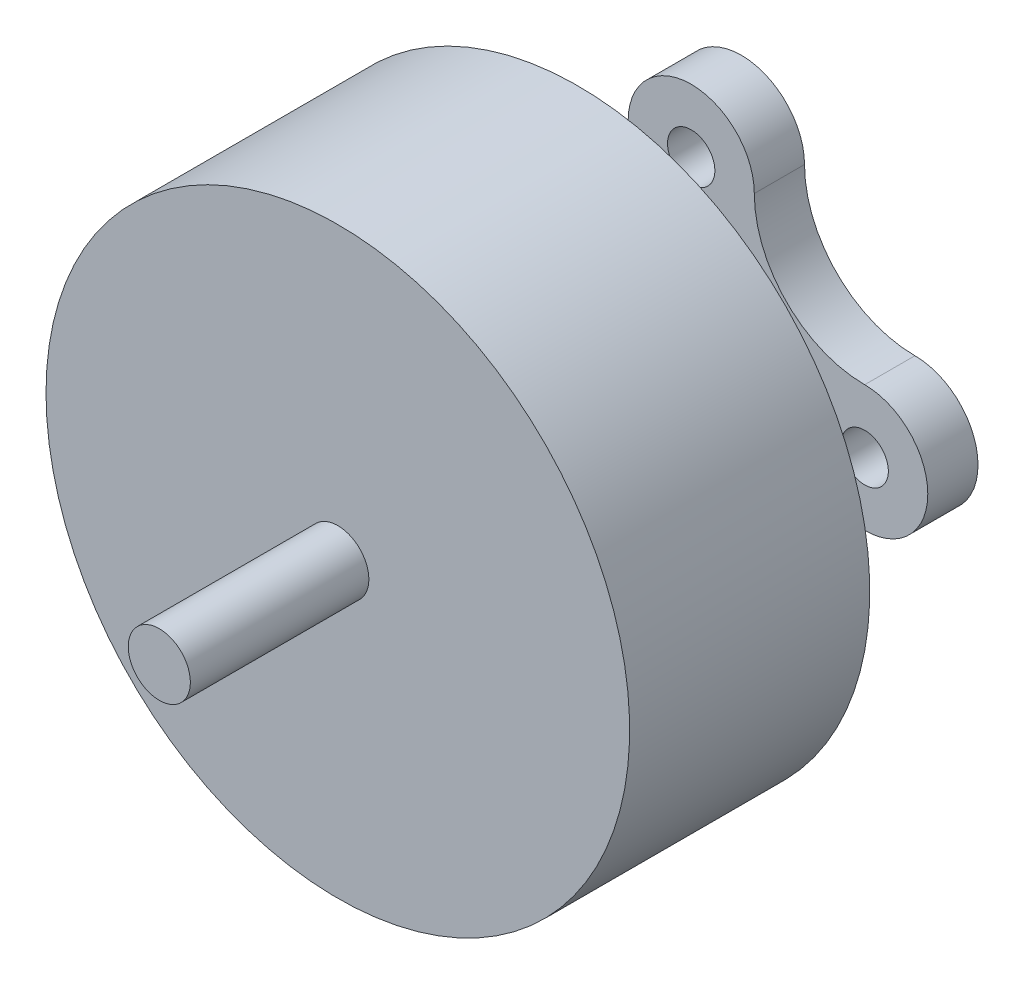
ISO-10303-21;
HEADER;
FILE_DESCRIPTION(('STEP AP214'),'2;1');
FILE_NAME('part.step','',(''),(''),'','','');
FILE_SCHEMA(('AUTOMOTIVE_DESIGN { 1 0 10303 214 1 1 1 1 }'));
ENDSEC;
DATA;
#1=APPLICATION_CONTEXT('core data for automotive mechanical design processes');
#2=APPLICATION_PROTOCOL_DEFINITION('international standard','automotive_design',2000,#1);
#3=PRODUCT_CONTEXT('',#1,'mechanical');
#4=PRODUCT('Part','Part','',(#3));
#5=PRODUCT_RELATED_PRODUCT_CATEGORY('part','',(#4));
#6=PRODUCT_DEFINITION_FORMATION('','',#4);
#7=PRODUCT_DEFINITION_CONTEXT('part definition',#1,'design');
#8=PRODUCT_DEFINITION('design','',#6,#7);
#9=PRODUCT_DEFINITION_SHAPE('','',#8);
#10=(LENGTH_UNIT() NAMED_UNIT(*) SI_UNIT(.MILLI.,.METRE.));
#11=(NAMED_UNIT(*) PLANE_ANGLE_UNIT() SI_UNIT($,.RADIAN.));
#12=(NAMED_UNIT(*) SI_UNIT($,.STERADIAN.) SOLID_ANGLE_UNIT());
#13=UNCERTAINTY_MEASURE_WITH_UNIT(LENGTH_MEASURE(1.E-05),#10,'distance_accuracy_value','');
#14=(GEOMETRIC_REPRESENTATION_CONTEXT(3) GLOBAL_UNCERTAINTY_ASSIGNED_CONTEXT((#13)) GLOBAL_UNIT_ASSIGNED_CONTEXT((#10,
#11,#12)) REPRESENTATION_CONTEXT('',''));
#15=CARTESIAN_POINT('',(0.,0.,0.));
#16=DIRECTION('',(0.,0.,1.));
#17=DIRECTION('',(1.,0.,0.));
#18=AXIS2_PLACEMENT_3D('',#15,#16,#17);
#19=CARTESIAN_POINT('',(9.4,0.,1.61731638714045));
#20=DIRECTION('',(0.,0.,1.));
#21=DIRECTION('',(1.,0.,0.));
#22=AXIS2_PLACEMENT_3D('',#19,#20,#21);
#23=PLANE('',#22);
#24=CARTESIAN_POINT('',(0.,0.,1.61731638714045));
#25=DIRECTION('',(0.,0.,-1.));
#26=DIRECTION('',(-1.,0.,0.));
#27=AXIS2_PLACEMENT_3D('',#24,#25,#26);
#28=CIRCLE('',#27,1.68292059225708);
#29=CARTESIAN_POINT('',(-1.68292059225708,0.,1.61731638714045));
#30=VERTEX_POINT('',#29);
#31=EDGE_CURVE('E235',#30,#30,#28,.T.);
#32=ORIENTED_EDGE('',*,*,#31,.T.);
#33=EDGE_LOOP('',(#32));
#34=FACE_BOUND('',#33,.T.);
#35=CARTESIAN_POINT('',(5.58799999999995,5.58800000000007,1.61731638714045));
#36=DIRECTION('',(0.,0.,1.));
#37=DIRECTION('',(1.,0.,0.));
#38=AXIS2_PLACEMENT_3D('',#35,#36,#37);
#39=CIRCLE('',#38,3.55600000000001);
#40=CARTESIAN_POINT('',(5.58799999999998,2.03200000000004,1.61731638714045));
#41=VERTEX_POINT('',#40);
#42=CARTESIAN_POINT('',(2.03199999999994,5.58800000000004,1.61731638714045));
#43=VERTEX_POINT('',#42);
#44=EDGE_CURVE('E160',#41,#43,#39,.F.);
#45=ORIENTED_EDGE('',*,*,#44,.T.);
#46=CARTESIAN_POINT('',(0.,5.588,1.61731638714045));
#47=DIRECTION('',(0.,0.,1.));
#48=DIRECTION('',(1.,0.,0.));
#49=AXIS2_PLACEMENT_3D('',#46,#47,#48);
#50=CIRCLE('',#49,2.032);
#51=CARTESIAN_POINT('',(-2.03200000000006,5.588,1.61731638714045));
#52=VERTEX_POINT('',#51);
#53=EDGE_CURVE('E146',#43,#52,#50,.T.);
#54=ORIENTED_EDGE('',*,*,#53,.T.);
#55=CARTESIAN_POINT('',(-5.58800000000001,5.58800000000001,1.61731638714045));
#56=DIRECTION('',(0.,0.,1.));
#57=DIRECTION('',(1.,0.,0.));
#58=AXIS2_PLACEMENT_3D('',#55,#56,#57);
#59=CIRCLE('',#58,3.55600000000001);
#60=CARTESIAN_POINT('',(-5.58800000000002,2.032,1.61731638714045));
#61=VERTEX_POINT('',#60);
#62=EDGE_CURVE('E134',#52,#61,#59,.F.);
#63=ORIENTED_EDGE('',*,*,#62,.T.);
#64=CARTESIAN_POINT('',(-5.588,0.,1.61731638714045));
#65=DIRECTION('',(0.,0.,1.));
#66=DIRECTION('',(1.,0.,0.));
#67=AXIS2_PLACEMENT_3D('',#64,#65,#66);
#68=CIRCLE('',#67,2.032);
#69=CARTESIAN_POINT('',(-5.58799999999999,-2.032,1.61731638714045));
#70=VERTEX_POINT('',#69);
#71=EDGE_CURVE('E145',#61,#70,#68,.T.);
#72=ORIENTED_EDGE('',*,*,#71,.T.);
#73=CARTESIAN_POINT('',(-5.58799999999999,-5.58800000000003,1.61731638714045));
#74=DIRECTION('',(0.,0.,1.));
#75=DIRECTION('',(1.,0.,0.));
#76=AXIS2_PLACEMENT_3D('',#73,#74,#75);
#77=CIRCLE('',#76,3.55600000000001);
#78=CARTESIAN_POINT('',(-2.03199999999998,-5.58800000000003,1.61731638714045));
#79=VERTEX_POINT('',#78);
#80=EDGE_CURVE('E174',#70,#79,#77,.F.);
#81=ORIENTED_EDGE('',*,*,#80,.T.);
#82=CARTESIAN_POINT('',(0.,-5.588,1.61731638714045));
#83=DIRECTION('',(0.,0.,1.));
#84=DIRECTION('',(1.,0.,0.));
#85=AXIS2_PLACEMENT_3D('',#82,#83,#84);
#86=CIRCLE('',#85,2.032);
#87=CARTESIAN_POINT('',(2.03200000000002,-5.588,1.61731638714045));
#88=VERTEX_POINT('',#87);
#89=EDGE_CURVE('E178',#79,#88,#86,.T.);
#90=ORIENTED_EDGE('',*,*,#89,.T.);
#91=CARTESIAN_POINT('',(5.58800000000005,-5.58799999999997,1.61731638714045));
#92=DIRECTION('',(0.,0.,1.));
#93=DIRECTION('',(1.,0.,0.));
#94=AXIS2_PLACEMENT_3D('',#91,#92,#93);
#95=CIRCLE('',#94,3.55600000000001);
#96=CARTESIAN_POINT('',(5.58800000000004,-2.03199999999996,1.61731638714045));
#97=VERTEX_POINT('',#96);
#98=EDGE_CURVE('E182',#88,#97,#95,.F.);
#99=ORIENTED_EDGE('',*,*,#98,.T.);
#100=CARTESIAN_POINT('',(5.588,0.,1.61731638714045));
#101=DIRECTION('',(0.,0.,1.));
#102=DIRECTION('',(1.,0.,0.));
#103=AXIS2_PLACEMENT_3D('',#100,#101,#102);
#104=CIRCLE('',#103,2.032);
#105=EDGE_CURVE('E186',#97,#41,#104,.T.);
#106=ORIENTED_EDGE('',*,*,#105,.T.);
#107=EDGE_LOOP('',(#45,#54,#63,#72,#81,#90,#99,#106));
#108=FACE_BOUND('',#107,.T.);
#109=CARTESIAN_POINT('',(5.58799999999987,-1.57794013350052E-13,1.61731638714045));
#110=DIRECTION('',(0.,0.,1.));
#111=DIRECTION('',(1.,0.,0.));
#112=AXIS2_PLACEMENT_3D('',#109,#110,#111);
#113=CIRCLE('',#112,0.762000000000303);
#114=CARTESIAN_POINT('',(6.35000000000017,-1.57794013350052E-13,1.61731638714045));
#115=VERTEX_POINT('',#114);
#116=EDGE_CURVE('E324',#115,#115,#113,.F.);
#117=ORIENTED_EDGE('',*,*,#116,.T.);
#118=EDGE_LOOP('',(#117));
#119=FACE_BOUND('',#118,.T.);
#120=CARTESIAN_POINT('',(0.,5.588,1.61731638714045));
#121=DIRECTION('',(0.,0.,1.));
#122=DIRECTION('',(1.,0.,0.));
#123=AXIS2_PLACEMENT_3D('',#120,#121,#122);
#124=CIRCLE('',#123,0.762);
#125=CARTESIAN_POINT('',(0.761999999999941,5.588,1.61731638714045));
#126=VERTEX_POINT('',#125);
#127=EDGE_CURVE('E327',#126,#126,#124,.F.);
#128=ORIENTED_EDGE('',*,*,#127,.T.);
#129=EDGE_LOOP('',(#128));
#130=FACE_BOUND('',#129,.T.);
#131=CARTESIAN_POINT('',(-5.58800000000018,1.57109680718689E-13,1.61731638714045));
#132=DIRECTION('',(0.,0.,1.));
#133=DIRECTION('',(1.,0.,0.));
#134=AXIS2_PLACEMENT_3D('',#131,#132,#133);
#135=CIRCLE('',#134,0.762000000000173);
#136=CARTESIAN_POINT('',(-4.826,1.57109680718689E-13,1.61731638714045));
#137=VERTEX_POINT('',#136);
#138=EDGE_CURVE('E169',#137,#137,#135,.F.);
#139=ORIENTED_EDGE('',*,*,#138,.T.);
#140=EDGE_LOOP('',(#139));
#141=FACE_BOUND('',#140,.T.);
#142=CARTESIAN_POINT('',(-3.13877195121696E-13,-5.58800000000002,1.61731638714045));
#143=DIRECTION('',(0.,0.,1.));
#144=DIRECTION('',(1.,0.,0.));
#145=AXIS2_PLACEMENT_3D('',#142,#143,#144);
#146=CIRCLE('',#145,0.762000000000387);
#147=CARTESIAN_POINT('',(0.762000000000073,-5.58800000000002,1.61731638714045));
#148=VERTEX_POINT('',#147);
#149=EDGE_CURVE('E162',#148,#148,#146,.F.);
#150=ORIENTED_EDGE('',*,*,#149,.T.);
#151=EDGE_LOOP('',(#150));
#152=FACE_BOUND('',#151,.T.);
#153=ADVANCED_FACE('F67',(#34,#108,#119,#130,#141,#152),#23,.T.);
#154=CARTESIAN_POINT('',(0.,0.,13.));
#155=DIRECTION('',(0.,0.,-1.));
#156=DIRECTION('',(-1.,0.,0.));
#157=AXIS2_PLACEMENT_3D('',#154,#155,#156);
#158=CYLINDRICAL_SURFACE('',#157,9.4);
#159=CARTESIAN_POINT('',(0.,0.,13.));
#160=DIRECTION('',(0.,0.,1.));
#161=DIRECTION('',(1.,0.,0.));
#162=AXIS2_PLACEMENT_3D('',#159,#160,#161);
#163=CIRCLE('',#162,9.4);
#164=CARTESIAN_POINT('',(-9.4,0.,13.));
#165=VERTEX_POINT('',#164);
#166=EDGE_CURVE('E12',#165,#165,#163,.T.);
#167=CARTESIAN_POINT('',(0.,0.,5.26635248511029));
#168=DIRECTION('',(0.,0.,-1.));
#169=DIRECTION('',(-1.,0.,0.));
#170=AXIS2_PLACEMENT_3D('',#167,#168,#169);
#171=CIRCLE('',#170,9.4);
#172=CARTESIAN_POINT('',(-9.4,0.,5.26635248511029));
#173=VERTEX_POINT('',#172);
#174=EDGE_CURVE('E243',#173,#173,#171,.T.);
#175=CARTESIAN_POINT('',(-9.4,0.,13.));
#176=CARTESIAN_POINT('',(-9.4,0.,12.9194411717199));
#177=CARTESIAN_POINT('',(-9.4,0.,12.8388823434398));
#178=CARTESIAN_POINT('',(-9.4,0.,12.6777646868796));
#179=CARTESIAN_POINT('',(-9.4,0.,12.5972058585995));
#180=CARTESIAN_POINT('',(-9.4,0.,12.4360882020393));
#181=CARTESIAN_POINT('',(-9.4,0.,12.3555293737592));
#182=CARTESIAN_POINT('',(-9.4,0.,12.194411717199));
#183=CARTESIAN_POINT('',(-9.4,0.,12.1138528889189));
#184=CARTESIAN_POINT('',(-9.4,0.,11.9527352323587));
#185=CARTESIAN_POINT('',(-9.4,0.,11.8721764040786));
#186=CARTESIAN_POINT('',(-9.4,0.,11.7110587475184));
#187=CARTESIAN_POINT('',(-9.4,0.,11.6304999192383));
#188=CARTESIAN_POINT('',(-9.4,0.,11.4693822626781));
#189=CARTESIAN_POINT('',(-9.4,0.,11.388823434398));
#190=CARTESIAN_POINT('',(-9.4,0.,11.2277057778378));
#191=CARTESIAN_POINT('',(-9.4,0.,11.1471469495577));
#192=CARTESIAN_POINT('',(-9.4,0.,10.9860292929975));
#193=CARTESIAN_POINT('',(-9.4,0.,10.9054704647174));
#194=CARTESIAN_POINT('',(-9.4,0.,10.7443528081572));
#195=CARTESIAN_POINT('',(-9.4,0.,10.6637939798771));
#196=CARTESIAN_POINT('',(-9.4,0.,10.5026763233169));
#197=CARTESIAN_POINT('',(-9.4,0.,10.4221174950368));
#198=CARTESIAN_POINT('',(-9.4,0.,10.2609998384766));
#199=CARTESIAN_POINT('',(-9.4,0.,10.1804410101965));
#200=CARTESIAN_POINT('',(-9.4,0.,10.0193233536363));
#201=CARTESIAN_POINT('',(-9.4,0.,9.93876452535616));
#202=CARTESIAN_POINT('',(-9.4,0.,9.77764686879596));
#203=CARTESIAN_POINT('',(-9.4,0.,9.69708804051585));
#204=CARTESIAN_POINT('',(-9.4,0.,9.53597038395565));
#205=CARTESIAN_POINT('',(-9.4,0.,9.45541155567555));
#206=CARTESIAN_POINT('',(-9.4,0.,9.29429389911535));
#207=CARTESIAN_POINT('',(-9.4,0.,9.21373507083525));
#208=CARTESIAN_POINT('',(-9.4,0.,9.05261741427505));
#209=CARTESIAN_POINT('',(-9.4,0.,8.97205858599494));
#210=CARTESIAN_POINT('',(-9.4,0.,8.81094092943474));
#211=CARTESIAN_POINT('',(-9.4,0.,8.73038210115464));
#212=CARTESIAN_POINT('',(-9.4,0.,8.56926444459444));
#213=CARTESIAN_POINT('',(-9.4,0.,8.48870561631434));
#214=CARTESIAN_POINT('',(-9.4,0.,8.32758795975414));
#215=CARTESIAN_POINT('',(-9.4,0.,8.24702913147403));
#216=CARTESIAN_POINT('',(-9.4,0.,8.08591147491383));
#217=CARTESIAN_POINT('',(-9.4,0.,8.00535264663373));
#218=CARTESIAN_POINT('',(-9.4,0.,7.84423499007353));
#219=CARTESIAN_POINT('',(-9.4,0.,7.76367616179343));
#220=CARTESIAN_POINT('',(-9.4,0.,7.60255850523323));
#221=CARTESIAN_POINT('',(-9.4,0.,7.52199967695312));
#222=CARTESIAN_POINT('',(-9.4,0.,7.36088202039292));
#223=CARTESIAN_POINT('',(-9.4,0.,7.28032319211282));
#224=CARTESIAN_POINT('',(-9.4,0.,7.11920553555262));
#225=CARTESIAN_POINT('',(-9.4,0.,7.03864670727252));
#226=CARTESIAN_POINT('',(-9.4,0.,6.87752905071232));
#227=CARTESIAN_POINT('',(-9.4,0.,6.79697022243221));
#228=CARTESIAN_POINT('',(-9.4,0.,6.63585256587201));
#229=CARTESIAN_POINT('',(-9.4,0.,6.55529373759191));
#230=CARTESIAN_POINT('',(-9.4,0.,6.39417608103171));
#231=CARTESIAN_POINT('',(-9.4,0.,6.31361725275161));
#232=CARTESIAN_POINT('',(-9.4,0.,6.15249959619141));
#233=CARTESIAN_POINT('',(-9.4,0.,6.0719407679113));
#234=CARTESIAN_POINT('',(-9.4,0.,5.9108231113511));
#235=CARTESIAN_POINT('',(-9.4,0.,5.830264283071));
#236=CARTESIAN_POINT('',(-9.4,0.,5.6691466265108));
#237=CARTESIAN_POINT('',(-9.4,0.,5.5885877982307));
#238=CARTESIAN_POINT('',(-9.4,0.,5.4274701416705));
#239=CARTESIAN_POINT('',(-9.4,0.,5.34691131339039));
#240=CARTESIAN_POINT('',(-9.4,0.,5.26635248511029));
#241=B_SPLINE_CURVE_WITH_KNOTS('',3,(#175,#176,#177,#178,#179,#180,#181,#182,#183,#184,#185,
#186,#187,#188,#189,#190,#191,#192,#193,#194,#195,#196,#197,#198,#199,#200,#201,#202,#203,#204,
#205,#206,#207,#208,#209,#210,#211,#212,#213,#214,#215,#216,#217,#218,#219,#220,#221,#222,#223,
#224,#225,#226,#227,#228,#229,#230,#231,#232,#233,#234,#235,#236,#237,#238,#239,#240),
.UNSPECIFIED.,.F.,.F.,(4,2,2,2,2,2,2,2,2,2,2,2,2,2,2,2,2,2,2,2,2,2,2,2,2,2,2,2,2,2,2,2,4),(0.,
0.241676484840303,0.483352969680606,0.725029454520909,0.966705939361212,1.20838242420152,
1.45005890904182,1.69173539388212,1.93341187872243,2.17508836356273,2.41676484840303,
2.65844133324333,2.90011781808364,3.14179430292394,3.38347078776425,3.62514727260455,
3.86682375744485,4.10850024228515,4.35017672712546,4.59185321196576,4.83352969680606,
5.07520618164637,5.31688266648667,5.55855915132697,5.80023563616728,6.04191212100758,
6.28358860584788,6.52526509068819,6.76694157552849,7.00861806036879,7.2502945452091,
7.4919710300494,7.7336475148897),.UNSPECIFIED.);
#242=EDGE_CURVE('BSEAM69',#165,#173,#241,.T.);
#243=ORIENTED_EDGE('',*,*,#166,.F.);
#244=ORIENTED_EDGE('',*,*,#174,.F.);
#245=ORIENTED_EDGE('',*,*,#242,.T.);
#246=ORIENTED_EDGE('',*,*,#242,.F.);
#247=EDGE_LOOP('',(#243,#245,#244,#246));
#248=FACE_BOUND('',#247,.T.);
#249=ADVANCED_FACE('F69',(#248),#158,.T.);
#250=CARTESIAN_POINT('',(0.,0.,13.));
#251=DIRECTION('',(0.,0.,1.));
#252=DIRECTION('',(1.,0.,0.));
#253=AXIS2_PLACEMENT_3D('',#250,#251,#252);
#254=PLANE('',#253);
#255=CARTESIAN_POINT('',(0.,0.,13.));
#256=DIRECTION('',(0.,0.,1.));
#257=DIRECTION('',(1.,0.,0.));
#258=AXIS2_PLACEMENT_3D('',#255,#256,#257);
#259=CIRCLE('',#258,1.);
#260=CARTESIAN_POINT('',(1.,0.,13.));
#261=VERTEX_POINT('',#260);
#262=EDGE_CURVE('E247',#261,#261,#259,.T.);
#263=ORIENTED_EDGE('',*,*,#262,.F.);
#264=EDGE_LOOP('',(#263));
#265=FACE_BOUND('',#264,.T.);
#266=ORIENTED_EDGE('',*,*,#166,.T.);
#267=EDGE_LOOP('',(#266));
#268=FACE_BOUND('',#267,.T.);
#269=ADVANCED_FACE('F256',(#265,#268),#254,.T.);
#270=CARTESIAN_POINT('',(0.,0.,18.75));
#271=DIRECTION('',(0.,0.,-1.));
#272=DIRECTION('',(-1.,0.,0.));
#273=AXIS2_PLACEMENT_3D('',#270,#271,#272);
#274=CYLINDRICAL_SURFACE('',#273,1.);
#275=CARTESIAN_POINT('',(0.,0.,18.75));
#276=DIRECTION('',(0.,0.,1.));
#277=DIRECTION('',(1.,0.,0.));
#278=AXIS2_PLACEMENT_3D('',#275,#276,#277);
#279=CIRCLE('',#278,1.);
#280=CARTESIAN_POINT('',(1.,0.,18.75));
#281=VERTEX_POINT('',#280);
#282=EDGE_CURVE('E76',#281,#281,#279,.T.);
#283=ORIENTED_EDGE('',*,*,#282,.F.);
#284=EDGE_LOOP('',(#283));
#285=FACE_BOUND('',#284,.T.);
#286=ORIENTED_EDGE('',*,*,#262,.T.);
#287=EDGE_LOOP('',(#286));
#288=FACE_BOUND('',#287,.T.);
#289=ADVANCED_FACE('F254',(#285,#288),#274,.T.);
#290=CARTESIAN_POINT('',(0.,0.,18.75));
#291=DIRECTION('',(0.,0.,1.));
#292=DIRECTION('',(1.,0.,0.));
#293=AXIS2_PLACEMENT_3D('',#290,#291,#292);
#294=PLANE('',#293);
#295=ORIENTED_EDGE('',*,*,#282,.T.);
#296=EDGE_LOOP('',(#295));
#297=FACE_BOUND('',#296,.T.);
#298=ADVANCED_FACE('F270',(#297),#294,.T.);
#299=CARTESIAN_POINT('',(9.4,0.,5.26635248511029));
#300=DIRECTION('',(0.,0.,-1.));
#301=DIRECTION('',(-1.,0.,0.));
#302=AXIS2_PLACEMENT_3D('',#299,#300,#301);
#303=PLANE('',#302);
#304=ORIENTED_EDGE('',*,*,#174,.T.);
#305=EDGE_LOOP('',(#304));
#306=FACE_BOUND('',#305,.T.);
#307=CARTESIAN_POINT('',(0.,0.,5.26635248511029));
#308=DIRECTION('',(0.,0.,-1.));
#309=DIRECTION('',(-1.,0.,0.));
#310=AXIS2_PLACEMENT_3D('',#307,#308,#309);
#311=CIRCLE('',#310,1.68292059225709);
#312=CARTESIAN_POINT('',(-1.68292059225709,0.,5.26635248511029));
#313=VERTEX_POINT('',#312);
#314=EDGE_CURVE('E239',#313,#313,#311,.T.);
#315=ORIENTED_EDGE('',*,*,#314,.F.);
#316=EDGE_LOOP('',(#315));
#317=FACE_BOUND('',#316,.T.);
#318=ADVANCED_FACE('F266',(#306,#317),#303,.T.);
#319=CARTESIAN_POINT('',(0.,0.,0.));
#320=DIRECTION('',(0.,0.,-1.));
#321=DIRECTION('',(-1.,0.,0.));
#322=AXIS2_PLACEMENT_3D('',#319,#320,#321);
#323=CYLINDRICAL_SURFACE('',#322,1.68292059225709);
#324=ORIENTED_EDGE('',*,*,#314,.T.);
#325=EDGE_LOOP('',(#324));
#326=FACE_BOUND('',#325,.T.);
#327=ORIENTED_EDGE('',*,*,#31,.F.);
#328=EDGE_LOOP('',(#327));
#329=FACE_BOUND('',#328,.T.);
#330=ADVANCED_FACE('F269',(#326,#329),#323,.T.);
#331=CARTESIAN_POINT('',(5.58799999999995,5.58800000000007,28.2045313597546));
#332=DIRECTION('',(0.,0.,-1.));
#333=DIRECTION('',(-1.,0.,0.));
#334=AXIS2_PLACEMENT_3D('',#331,#332,#333);
#335=CYLINDRICAL_SURFACE('',#334,3.55600000000001);
#336=DIRECTION('',(0.,0.,-1.));
#337=VECTOR('',#336,1.);
#338=CARTESIAN_POINT('',(5.58799999999998,2.03200000000006,28.2045313597546));
#339=LINE('',#338,#337);
#340=CARTESIAN_POINT('',(5.58799999999998,2.03200000000006,0.));
#341=VERTEX_POINT('',#340);
#342=EDGE_CURVE('E83',#41,#341,#339,.T.);
#343=ORIENTED_EDGE('',*,*,#342,.T.);
#344=CARTESIAN_POINT('',(5.58799999999995,5.58800000000007,0.));
#345=DIRECTION('',(0.,0.,-1.));
#346=DIRECTION('',(-1.,0.,0.));
#347=AXIS2_PLACEMENT_3D('',#344,#345,#346);
#348=CIRCLE('',#347,3.55600000000001);
#349=CARTESIAN_POINT('',(2.03199999999994,5.58800000000004,0.));
#350=VERTEX_POINT('',#349);
#351=EDGE_CURVE('E192',#341,#350,#348,.T.);
#352=ORIENTED_EDGE('',*,*,#351,.T.);
#353=DIRECTION('',(0.,0.,-1.));
#354=VECTOR('',#353,1.);
#355=CARTESIAN_POINT('',(2.03199999999994,5.58800000000004,28.2045313597546));
#356=LINE('',#355,#354);
#357=EDGE_CURVE('E155',#43,#350,#356,.T.);
#358=ORIENTED_EDGE('',*,*,#357,.F.);
#359=ORIENTED_EDGE('',*,*,#44,.F.);
#360=EDGE_LOOP('',(#343,#352,#358,#359));
#361=FACE_BOUND('',#360,.T.);
#362=ADVANCED_FACE('F276',(#361),#335,.F.);
#363=CARTESIAN_POINT('',(0.,5.588,28.2045313597546));
#364=DIRECTION('',(0.,0.,-1.));
#365=DIRECTION('',(-1.,0.,0.));
#366=AXIS2_PLACEMENT_3D('',#363,#364,#365);
#367=CYLINDRICAL_SURFACE('',#366,2.032);
#368=ORIENTED_EDGE('',*,*,#357,.T.);
#369=CARTESIAN_POINT('',(0.,5.588,0.));
#370=DIRECTION('',(0.,0.,-1.));
#371=DIRECTION('',(-1.,0.,0.));
#372=AXIS2_PLACEMENT_3D('',#369,#370,#371);
#373=CIRCLE('',#372,2.032);
#374=CARTESIAN_POINT('',(-2.032,5.588,0.));
#375=VERTEX_POINT('',#374);
#376=EDGE_CURVE('E152',#350,#375,#373,.F.);
#377=ORIENTED_EDGE('',*,*,#376,.T.);
#378=DIRECTION('',(0.,0.,-1.));
#379=VECTOR('',#378,1.);
#380=CARTESIAN_POINT('',(-2.032,5.588,28.2045313597546));
#381=LINE('',#380,#379);
#382=EDGE_CURVE('E138',#52,#375,#381,.T.);
#383=ORIENTED_EDGE('',*,*,#382,.F.);
#384=ORIENTED_EDGE('',*,*,#53,.F.);
#385=EDGE_LOOP('',(#368,#377,#383,#384));
#386=FACE_BOUND('',#385,.T.);
#387=ADVANCED_FACE('F149',(#386),#367,.T.);
#388=CARTESIAN_POINT('',(-5.58800000000001,5.58800000000001,28.2045313597546));
#389=DIRECTION('',(0.,0.,-1.));
#390=DIRECTION('',(-1.,0.,0.));
#391=AXIS2_PLACEMENT_3D('',#388,#389,#390);
#392=CYLINDRICAL_SURFACE('',#391,3.55600000000001);
#393=ORIENTED_EDGE('',*,*,#382,.T.);
#394=CARTESIAN_POINT('',(-5.58800000000001,5.58800000000001,0.));
#395=DIRECTION('',(0.,0.,-1.));
#396=DIRECTION('',(-1.,0.,0.));
#397=AXIS2_PLACEMENT_3D('',#394,#395,#396);
#398=CIRCLE('',#397,3.55600000000001);
#399=CARTESIAN_POINT('',(-5.58800000000002,2.032,0.));
#400=VERTEX_POINT('',#399);
#401=EDGE_CURVE('E198',#375,#400,#398,.T.);
#402=ORIENTED_EDGE('',*,*,#401,.T.);
#403=DIRECTION('',(0.,0.,-1.));
#404=VECTOR('',#403,1.);
#405=CARTESIAN_POINT('',(-5.58800000000002,2.032,28.2045313597546));
#406=LINE('',#405,#404);
#407=EDGE_CURVE('E140',#61,#400,#406,.T.);
#408=ORIENTED_EDGE('',*,*,#407,.F.);
#409=ORIENTED_EDGE('',*,*,#62,.F.);
#410=EDGE_LOOP('',(#393,#402,#408,#409));
#411=FACE_BOUND('',#410,.T.);
#412=ADVANCED_FACE('F136',(#411),#392,.F.);
#413=CARTESIAN_POINT('',(-5.588,0.,28.2045313597546));
#414=DIRECTION('',(0.,0.,-1.));
#415=DIRECTION('',(-1.,0.,0.));
#416=AXIS2_PLACEMENT_3D('',#413,#414,#415);
#417=CYLINDRICAL_SURFACE('',#416,2.032);
#418=ORIENTED_EDGE('',*,*,#407,.T.);
#419=CARTESIAN_POINT('',(-5.588,0.,0.));
#420=DIRECTION('',(0.,0.,-1.));
#421=DIRECTION('',(-1.,0.,0.));
#422=AXIS2_PLACEMENT_3D('',#419,#420,#421);
#423=CIRCLE('',#422,2.032);
#424=CARTESIAN_POINT('',(-5.58799999999999,-2.03200000000002,0.));
#425=VERTEX_POINT('',#424);
#426=EDGE_CURVE('E201',#400,#425,#423,.F.);
#427=ORIENTED_EDGE('',*,*,#426,.T.);
#428=DIRECTION('',(0.,0.,-1.));
#429=VECTOR('',#428,1.);
#430=CARTESIAN_POINT('',(-5.58799999999999,-2.03200000000002,28.2045313597546));
#431=LINE('',#430,#429);
#432=EDGE_CURVE('E224',#70,#425,#431,.T.);
#433=ORIENTED_EDGE('',*,*,#432,.F.);
#434=ORIENTED_EDGE('',*,*,#71,.F.);
#435=EDGE_LOOP('',(#418,#427,#433,#434));
#436=FACE_BOUND('',#435,.T.);
#437=ADVANCED_FACE('F365',(#436),#417,.T.);
#438=CARTESIAN_POINT('',(-5.58799999999999,-5.58800000000003,28.2045313597546));
#439=DIRECTION('',(0.,0.,-1.));
#440=DIRECTION('',(-1.,0.,0.));
#441=AXIS2_PLACEMENT_3D('',#438,#439,#440);
#442=CYLINDRICAL_SURFACE('',#441,3.55600000000001);
#443=ORIENTED_EDGE('',*,*,#432,.T.);
#444=CARTESIAN_POINT('',(-5.58799999999999,-5.58800000000003,0.));
#445=DIRECTION('',(0.,0.,-1.));
#446=DIRECTION('',(-1.,0.,0.));
#447=AXIS2_PLACEMENT_3D('',#444,#445,#446);
#448=CIRCLE('',#447,3.55600000000001);
#449=CARTESIAN_POINT('',(-2.03199999999998,-5.588,0.));
#450=VERTEX_POINT('',#449);
#451=EDGE_CURVE('E205',#425,#450,#448,.T.);
#452=ORIENTED_EDGE('',*,*,#451,.T.);
#453=DIRECTION('',(0.,0.,-1.));
#454=VECTOR('',#453,1.);
#455=CARTESIAN_POINT('',(-2.03199999999998,-5.588,28.2045313597546));
#456=LINE('',#455,#454);
#457=EDGE_CURVE('E221',#79,#450,#456,.T.);
#458=ORIENTED_EDGE('',*,*,#457,.F.);
#459=ORIENTED_EDGE('',*,*,#80,.F.);
#460=EDGE_LOOP('',(#443,#452,#458,#459));
#461=FACE_BOUND('',#460,.T.);
#462=ADVANCED_FACE('F361',(#461),#442,.F.);
#463=CARTESIAN_POINT('',(0.,-5.588,28.2045313597546));
#464=DIRECTION('',(0.,0.,-1.));
#465=DIRECTION('',(-1.,0.,0.));
#466=AXIS2_PLACEMENT_3D('',#463,#464,#465);
#467=CYLINDRICAL_SURFACE('',#466,2.032);
#468=ORIENTED_EDGE('',*,*,#457,.T.);
#469=CARTESIAN_POINT('',(0.,-5.588,0.));
#470=DIRECTION('',(0.,0.,-1.));
#471=DIRECTION('',(-1.,0.,0.));
#472=AXIS2_PLACEMENT_3D('',#469,#470,#471);
#473=CIRCLE('',#472,2.032);
#474=CARTESIAN_POINT('',(2.03200000000004,-5.58799999999997,0.));
#475=VERTEX_POINT('',#474);
#476=EDGE_CURVE('E209',#450,#475,#473,.F.);
#477=ORIENTED_EDGE('',*,*,#476,.T.);
#478=DIRECTION('',(0.,0.,-1.));
#479=VECTOR('',#478,1.);
#480=CARTESIAN_POINT('',(2.03200000000004,-5.58799999999997,28.2045313597546));
#481=LINE('',#480,#479);
#482=EDGE_CURVE('E218',#88,#475,#481,.T.);
#483=ORIENTED_EDGE('',*,*,#482,.F.);
#484=ORIENTED_EDGE('',*,*,#89,.F.);
#485=EDGE_LOOP('',(#468,#477,#483,#484));
#486=FACE_BOUND('',#485,.T.);
#487=ADVANCED_FACE('F358',(#486),#467,.T.);
#488=CARTESIAN_POINT('',(5.58800000000005,-5.58799999999997,28.2045313597546));
#489=DIRECTION('',(0.,0.,-1.));
#490=DIRECTION('',(-1.,0.,0.));
#491=AXIS2_PLACEMENT_3D('',#488,#489,#490);
#492=CYLINDRICAL_SURFACE('',#491,3.55600000000001);
#493=ORIENTED_EDGE('',*,*,#482,.T.);
#494=CARTESIAN_POINT('',(5.58800000000005,-5.58799999999997,0.));
#495=DIRECTION('',(0.,0.,-1.));
#496=DIRECTION('',(-1.,0.,0.));
#497=AXIS2_PLACEMENT_3D('',#494,#495,#496);
#498=CIRCLE('',#497,3.55600000000001);
#499=CARTESIAN_POINT('',(5.58800000000004,-2.03199999999996,0.));
#500=VERTEX_POINT('',#499);
#501=EDGE_CURVE('E91',#475,#500,#498,.T.);
#502=ORIENTED_EDGE('',*,*,#501,.T.);
#503=DIRECTION('',(0.,0.,-1.));
#504=VECTOR('',#503,1.);
#505=CARTESIAN_POINT('',(5.58800000000004,-2.03199999999996,28.2045313597546));
#506=LINE('',#505,#504);
#507=EDGE_CURVE('E215',#97,#500,#506,.T.);
#508=ORIENTED_EDGE('',*,*,#507,.F.);
#509=ORIENTED_EDGE('',*,*,#98,.F.);
#510=EDGE_LOOP('',(#493,#502,#508,#509));
#511=FACE_BOUND('',#510,.T.);
#512=ADVANCED_FACE('F352',(#511),#492,.F.);
#513=CARTESIAN_POINT('',(5.588,0.,28.2045313597546));
#514=DIRECTION('',(0.,0.,-1.));
#515=DIRECTION('',(-1.,0.,0.));
#516=AXIS2_PLACEMENT_3D('',#513,#514,#515);
#517=CYLINDRICAL_SURFACE('',#516,2.032);
#518=ORIENTED_EDGE('',*,*,#507,.T.);
#519=CARTESIAN_POINT('',(5.588,0.,0.));
#520=DIRECTION('',(0.,0.,-1.));
#521=DIRECTION('',(-1.,0.,0.));
#522=AXIS2_PLACEMENT_3D('',#519,#520,#521);
#523=CIRCLE('',#522,2.032);
#524=EDGE_CURVE('E189',#500,#341,#523,.F.);
#525=ORIENTED_EDGE('',*,*,#524,.T.);
#526=ORIENTED_EDGE('',*,*,#342,.F.);
#527=ORIENTED_EDGE('',*,*,#105,.F.);
#528=EDGE_LOOP('',(#518,#525,#526,#527));
#529=FACE_BOUND('',#528,.T.);
#530=ADVANCED_FACE('F285',(#529),#517,.T.);
#531=CARTESIAN_POINT('',(5.58799999999987,-1.57794013350052E-13,28.2045313597546));
#532=DIRECTION('',(0.,0.,-1.));
#533=DIRECTION('',(-1.,0.,0.));
#534=AXIS2_PLACEMENT_3D('',#531,#532,#533);
#535=CYLINDRICAL_SURFACE('',#534,0.762000000000303);
#536=CARTESIAN_POINT('',(5.58799999999987,-1.57794013350052E-13,0.));
#537=DIRECTION('',(0.,0.,-1.));
#538=DIRECTION('',(-1.,0.,0.));
#539=AXIS2_PLACEMENT_3D('',#536,#537,#538);
#540=CIRCLE('',#539,0.762000000000303);
#541=CARTESIAN_POINT('',(4.82599999999956,-1.57794013350052E-13,0.));
#542=VERTEX_POINT('',#541);
#543=EDGE_CURVE('E310',#542,#542,#540,.T.);
#544=ORIENTED_EDGE('',*,*,#543,.T.);
#545=EDGE_LOOP('',(#544));
#546=FACE_BOUND('',#545,.T.);
#547=ORIENTED_EDGE('',*,*,#116,.F.);
#548=EDGE_LOOP('',(#547));
#549=FACE_BOUND('',#548,.T.);
#550=ADVANCED_FACE('F342',(#546,#549),#535,.F.);
#551=CARTESIAN_POINT('',(0.,5.588,28.2045313597546));
#552=DIRECTION('',(0.,0.,-1.));
#553=DIRECTION('',(-1.,0.,0.));
#554=AXIS2_PLACEMENT_3D('',#551,#552,#553);
#555=CYLINDRICAL_SURFACE('',#554,0.762);
#556=CARTESIAN_POINT('',(0.,5.588,0.));
#557=DIRECTION('',(0.,0.,-1.));
#558=DIRECTION('',(-1.,0.,0.));
#559=AXIS2_PLACEMENT_3D('',#556,#557,#558);
#560=CIRCLE('',#559,0.762);
#561=CARTESIAN_POINT('',(-0.762000000000059,5.588,0.));
#562=VERTEX_POINT('',#561);
#563=EDGE_CURVE('E316',#562,#562,#560,.T.);
#564=ORIENTED_EDGE('',*,*,#563,.T.);
#565=EDGE_LOOP('',(#564));
#566=FACE_BOUND('',#565,.T.);
#567=ORIENTED_EDGE('',*,*,#127,.F.);
#568=EDGE_LOOP('',(#567));
#569=FACE_BOUND('',#568,.T.);
#570=ADVANCED_FACE('F344',(#566,#569),#555,.F.);
#571=CARTESIAN_POINT('',(-5.58800000000018,1.57109680718689E-13,28.2045313597546));
#572=DIRECTION('',(0.,0.,-1.));
#573=DIRECTION('',(-1.,0.,0.));
#574=AXIS2_PLACEMENT_3D('',#571,#572,#573);
#575=CYLINDRICAL_SURFACE('',#574,0.762000000000173);
#576=CARTESIAN_POINT('',(-5.58800000000018,1.57109680718689E-13,0.));
#577=DIRECTION('',(0.,0.,-1.));
#578=DIRECTION('',(-1.,0.,0.));
#579=AXIS2_PLACEMENT_3D('',#576,#577,#578);
#580=CIRCLE('',#579,0.762000000000173);
#581=CARTESIAN_POINT('',(-6.35000000000035,1.57109680718689E-13,0.));
#582=VERTEX_POINT('',#581);
#583=EDGE_CURVE('E306',#582,#582,#580,.T.);
#584=ORIENTED_EDGE('',*,*,#583,.T.);
#585=EDGE_LOOP('',(#584));
#586=FACE_BOUND('',#585,.T.);
#587=ORIENTED_EDGE('',*,*,#138,.F.);
#588=EDGE_LOOP('',(#587));
#589=FACE_BOUND('',#588,.T.);
#590=ADVANCED_FACE('F300',(#586,#589),#575,.F.);
#591=CARTESIAN_POINT('',(-3.13877195121696E-13,-5.58800000000002,28.2045313597546));
#592=DIRECTION('',(0.,0.,-1.));
#593=DIRECTION('',(-1.,0.,0.));
#594=AXIS2_PLACEMENT_3D('',#591,#592,#593);
#595=CYLINDRICAL_SURFACE('',#594,0.762000000000387);
#596=CARTESIAN_POINT('',(-3.13877195121696E-13,-5.58800000000002,0.));
#597=DIRECTION('',(0.,0.,-1.));
#598=DIRECTION('',(-1.,0.,0.));
#599=AXIS2_PLACEMENT_3D('',#596,#597,#598);
#600=CIRCLE('',#599,0.762000000000387);
#601=CARTESIAN_POINT('',(-0.762000000000701,-5.58800000000002,0.));
#602=VERTEX_POINT('',#601);
#603=EDGE_CURVE('E166',#602,#602,#600,.T.);
#604=ORIENTED_EDGE('',*,*,#603,.T.);
#605=EDGE_LOOP('',(#604));
#606=FACE_BOUND('',#605,.T.);
#607=ORIENTED_EDGE('',*,*,#149,.F.);
#608=EDGE_LOOP('',(#607));
#609=FACE_BOUND('',#608,.T.);
#610=ADVANCED_FACE('F295',(#606,#609),#595,.F.);
#611=CARTESIAN_POINT('',(0.,0.,0.));
#612=DIRECTION('',(0.,0.,1.));
#613=DIRECTION('',(1.,0.,0.));
#614=AXIS2_PLACEMENT_3D('',#611,#612,#613);
#615=PLANE('',#614);
#616=ORIENTED_EDGE('',*,*,#583,.F.);
#617=EDGE_LOOP('',(#616));
#618=FACE_BOUND('',#617,.T.);
#619=ORIENTED_EDGE('',*,*,#543,.F.);
#620=EDGE_LOOP('',(#619));
#621=FACE_BOUND('',#620,.T.);
#622=ORIENTED_EDGE('',*,*,#376,.F.);
#623=ORIENTED_EDGE('',*,*,#351,.F.);
#624=ORIENTED_EDGE('',*,*,#524,.F.);
#625=ORIENTED_EDGE('',*,*,#501,.F.);
#626=ORIENTED_EDGE('',*,*,#476,.F.);
#627=ORIENTED_EDGE('',*,*,#451,.F.);
#628=ORIENTED_EDGE('',*,*,#426,.F.);
#629=ORIENTED_EDGE('',*,*,#401,.F.);
#630=EDGE_LOOP('',(#622,#623,#624,#625,#626,#627,#628,#629));
#631=FACE_BOUND('',#630,.T.);
#632=ORIENTED_EDGE('',*,*,#563,.F.);
#633=EDGE_LOOP('',(#632));
#634=FACE_BOUND('',#633,.T.);
#635=ORIENTED_EDGE('',*,*,#603,.F.);
#636=EDGE_LOOP('',(#635));
#637=FACE_BOUND('',#636,.T.);
#638=ADVANCED_FACE('F293',(#618,#621,#631,#634,#637),#615,.F.);
#639=CLOSED_SHELL('',(#153,#249,#269,#289,#298,#318,#330,#362,#387,#412,#437,#462,#487,#512,
#530,#550,#570,#590,#610,#638));
#640=MANIFOLD_SOLID_BREP('B2',#639);
#641=ADVANCED_BREP_SHAPE_REPRESENTATION('',(#18,#640),#14);
#642=SHAPE_DEFINITION_REPRESENTATION(#9,#641);
ENDSEC;
END-ISO-10303-21;
